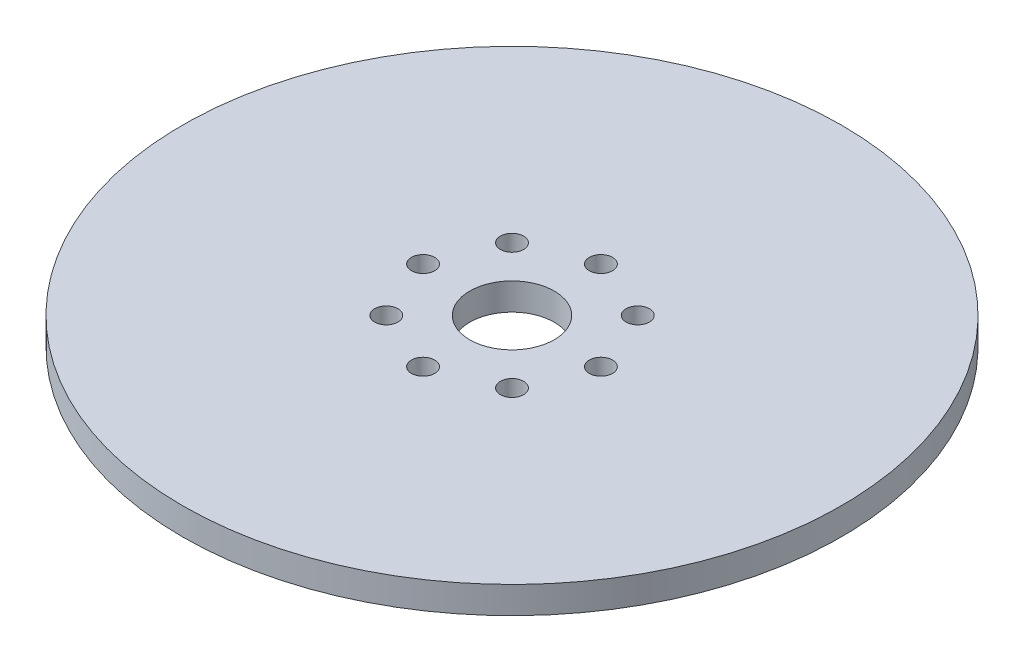
ISO-10303-21;
HEADER;
FILE_DESCRIPTION(('STEP AP214'),'2;1');
FILE_NAME('part.step','',(''),(''),'','','');
FILE_SCHEMA(('AUTOMOTIVE_DESIGN { 1 0 10303 214 1 1 1 1 }'));
ENDSEC;
DATA;
#1=APPLICATION_CONTEXT('core data for automotive mechanical design processes');
#2=APPLICATION_PROTOCOL_DEFINITION('international standard','automotive_design',2000,#1);
#3=PRODUCT_CONTEXT('',#1,'mechanical');
#4=PRODUCT('Part','Part','',(#3));
#5=PRODUCT_RELATED_PRODUCT_CATEGORY('part','',(#4));
#6=PRODUCT_DEFINITION_FORMATION('','',#4);
#7=PRODUCT_DEFINITION_CONTEXT('part definition',#1,'design');
#8=PRODUCT_DEFINITION('design','',#6,#7);
#9=PRODUCT_DEFINITION_SHAPE('','',#8);
#10=(LENGTH_UNIT() NAMED_UNIT(*) SI_UNIT(.MILLI.,.METRE.));
#11=(NAMED_UNIT(*) PLANE_ANGLE_UNIT() SI_UNIT($,.RADIAN.));
#12=(NAMED_UNIT(*) SI_UNIT($,.STERADIAN.) SOLID_ANGLE_UNIT());
#13=UNCERTAINTY_MEASURE_WITH_UNIT(LENGTH_MEASURE(1.E-05),#10,'distance_accuracy_value','');
#14=(GEOMETRIC_REPRESENTATION_CONTEXT(3) GLOBAL_UNCERTAINTY_ASSIGNED_CONTEXT((#13)) GLOBAL_UNIT_ASSIGNED_CONTEXT((#10,
#11,#12)) REPRESENTATION_CONTEXT('',''));
#15=CARTESIAN_POINT('',(0.,0.,0.));
#16=DIRECTION('',(0.,0.,1.));
#17=DIRECTION('',(1.,0.,0.));
#18=AXIS2_PLACEMENT_3D('',#15,#16,#17);
#19=CARTESIAN_POINT('',(0.,8.,0.));
#20=DIRECTION('',(0.,-1.,0.));
#21=DIRECTION('',(0.,0.,-1.));
#22=AXIS2_PLACEMENT_3D('',#19,#20,#21);
#23=CYLINDRICAL_SURFACE('',#22,97.5);
#24=CARTESIAN_POINT('',(0.,8.,0.));
#25=DIRECTION('',(0.,1.,0.));
#26=DIRECTION('',(0.,0.,1.));
#27=AXIS2_PLACEMENT_3D('',#24,#25,#26);
#28=CIRCLE('',#27,97.5);
#29=CARTESIAN_POINT('',(0.,8.,97.5));
#30=VERTEX_POINT('',#29);
#31=EDGE_CURVE('E10',#30,#30,#28,.T.);
#32=ORIENTED_EDGE('',*,*,#31,.F.);
#33=EDGE_LOOP('',(#32));
#34=FACE_BOUND('',#33,.T.);
#35=CARTESIAN_POINT('',(0.,0.,0.));
#36=DIRECTION('',(0.,1.,0.));
#37=DIRECTION('',(0.,0.,1.));
#38=AXIS2_PLACEMENT_3D('',#35,#36,#37);
#39=CIRCLE('',#38,97.5);
#40=CARTESIAN_POINT('',(0.,0.,97.5));
#41=VERTEX_POINT('',#40);
#42=EDGE_CURVE('E37',#41,#41,#39,.T.);
#43=ORIENTED_EDGE('',*,*,#42,.T.);
#44=EDGE_LOOP('',(#43));
#45=FACE_BOUND('',#44,.T.);
#46=ADVANCED_FACE('F40',(#34,#45),#23,.T.);
#47=CARTESIAN_POINT('',(0.,8.,0.));
#48=DIRECTION('',(0.,1.,0.));
#49=DIRECTION('',(0.,0.,1.));
#50=AXIS2_PLACEMENT_3D('',#47,#48,#49);
#51=PLANE('',#50);
#52=CARTESIAN_POINT('',(0.,8.,26.3054994431881));
#53=DIRECTION('',(0.,1.,0.));
#54=DIRECTION('',(1.,0.,0.));
#55=AXIS2_PLACEMENT_3D('',#52,#53,#54);
#56=CIRCLE('',#55,3.44191660066222);
#57=CARTESIAN_POINT('',(3.44191660066231,8.,26.305499443188));
#58=VERTEX_POINT('',#57);
#59=EDGE_CURVE('E88',#58,#58,#56,.T.);
#60=ORIENTED_EDGE('',*,*,#59,.F.);
#61=EDGE_LOOP('',(#60));
#62=FACE_BOUND('',#61,.T.);
#63=CARTESIAN_POINT('',(18.6007970387773,8.,18.6007970387771));
#64=DIRECTION('',(0.,1.,0.));
#65=DIRECTION('',(0.707106781186544,0.,-0.707106781186551));
#66=AXIS2_PLACEMENT_3D('',#63,#64,#65);
#67=CIRCLE('',#66,3.44191660066222);
#68=CARTESIAN_POINT('',(21.0345996073841,8.,16.1669944701703));
#69=VERTEX_POINT('',#68);
#70=EDGE_CURVE('E79',#69,#69,#67,.T.);
#71=ORIENTED_EDGE('',*,*,#70,.F.);
#72=EDGE_LOOP('',(#71));
#73=FACE_BOUND('',#72,.T.);
#74=CARTESIAN_POINT('',(26.3054994431881,8.,0.));
#75=DIRECTION('',(0.,1.,0.));
#76=DIRECTION('',(0.,0.,-1.));
#77=AXIS2_PLACEMENT_3D('',#74,#75,#76);
#78=CIRCLE('',#77,3.44191660066222);
#79=CARTESIAN_POINT('',(26.3054994431881,8.,-3.44191660066222));
#80=VERTEX_POINT('',#79);
#81=EDGE_CURVE('E74',#80,#80,#78,.T.);
#82=ORIENTED_EDGE('',*,*,#81,.F.);
#83=EDGE_LOOP('',(#82));
#84=FACE_BOUND('',#83,.T.);
#85=CARTESIAN_POINT('',(18.6007970387771,8.,-18.6007970387774));
#86=DIRECTION('',(0.,1.,0.));
#87=DIRECTION('',(-0.707106781186554,0.,-0.707106781186541));
#88=AXIS2_PLACEMENT_3D('',#85,#86,#87);
#89=CIRCLE('',#88,3.44191660066222);
#90=CARTESIAN_POINT('',(16.1669944701702,8.,-21.0345996073842));
#91=VERTEX_POINT('',#90);
#92=EDGE_CURVE('E70',#91,#91,#89,.T.);
#93=ORIENTED_EDGE('',*,*,#92,.F.);
#94=EDGE_LOOP('',(#93));
#95=FACE_BOUND('',#94,.T.);
#96=CARTESIAN_POINT('',(-2.75535481244519E-13,8.,-26.3054994431881));
#97=DIRECTION('',(0.,1.,0.));
#98=DIRECTION('',(-1.,0.,0.));
#99=AXIS2_PLACEMENT_3D('',#96,#97,#98);
#100=CIRCLE('',#99,3.44191660066222);
#101=CARTESIAN_POINT('',(-3.44191660066249,8.,-26.305499443188));
#102=VERTEX_POINT('',#101);
#103=EDGE_CURVE('E100',#102,#102,#100,.T.);
#104=ORIENTED_EDGE('',*,*,#103,.F.);
#105=EDGE_LOOP('',(#104));
#106=FACE_BOUND('',#105,.T.);
#107=CARTESIAN_POINT('',(-18.6007970387774,8.,-18.600797038777));
#108=DIRECTION('',(0.,1.,0.));
#109=DIRECTION('',(-0.707106781186539,0.,0.707106781186556));
#110=AXIS2_PLACEMENT_3D('',#107,#108,#109);
#111=CIRCLE('',#110,3.44191660066222);
#112=CARTESIAN_POINT('',(-21.0345996073842,8.,-16.1669944701702));
#113=VERTEX_POINT('',#112);
#114=EDGE_CURVE('E93',#113,#113,#111,.T.);
#115=ORIENTED_EDGE('',*,*,#114,.F.);
#116=EDGE_LOOP('',(#115));
#117=FACE_BOUND('',#116,.T.);
#118=CARTESIAN_POINT('',(-18.6007970387772,8.,18.6007970387773));
#119=DIRECTION('',(0.,1.,0.));
#120=DIRECTION('',(0.707106781186549,0.,0.707106781186546));
#121=AXIS2_PLACEMENT_3D('',#118,#119,#120);
#122=CIRCLE('',#121,3.44191660066222);
#123=CARTESIAN_POINT('',(-16.1669944701704,8.,21.0345996073841));
#124=VERTEX_POINT('',#123);
#125=EDGE_CURVE('E61',#124,#124,#122,.T.);
#126=ORIENTED_EDGE('',*,*,#125,.F.);
#127=EDGE_LOOP('',(#126));
#128=FACE_BOUND('',#127,.T.);
#129=CARTESIAN_POINT('',(-26.3054994431881,8.,0.));
#130=DIRECTION('',(0.,1.,0.));
#131=DIRECTION('',(0.,0.,1.));
#132=AXIS2_PLACEMENT_3D('',#129,#130,#131);
#133=CIRCLE('',#132,3.44191660066222);
#134=CARTESIAN_POINT('',(-26.3054994431881,8.,3.44191660066222));
#135=VERTEX_POINT('',#134);
#136=EDGE_CURVE('E54',#135,#135,#133,.T.);
#137=ORIENTED_EDGE('',*,*,#136,.F.);
#138=EDGE_LOOP('',(#137));
#139=FACE_BOUND('',#138,.T.);
#140=CARTESIAN_POINT('',(0.,8.,0.));
#141=DIRECTION('',(0.,1.,0.));
#142=DIRECTION('',(0.,0.,1.));
#143=AXIS2_PLACEMENT_3D('',#140,#141,#142);
#144=CIRCLE('',#143,12.5);
#145=CARTESIAN_POINT('',(0.,8.,12.5));
#146=VERTEX_POINT('',#145);
#147=EDGE_CURVE('E50',#146,#146,#144,.T.);
#148=ORIENTED_EDGE('',*,*,#147,.F.);
#149=EDGE_LOOP('',(#148));
#150=FACE_BOUND('',#149,.T.);
#151=ORIENTED_EDGE('',*,*,#31,.T.);
#152=EDGE_LOOP('',(#151));
#153=FACE_BOUND('',#152,.T.);
#154=ADVANCED_FACE('F115',(#62,#73,#84,#95,#106,#117,#128,#139,#150,#153),#51,.T.);
#155=CARTESIAN_POINT('',(0.,0.,0.));
#156=DIRECTION('',(0.,1.,0.));
#157=DIRECTION('',(0.,0.,1.));
#158=AXIS2_PLACEMENT_3D('',#155,#156,#157);
#159=PLANE('',#158);
#160=CARTESIAN_POINT('',(0.,0.,0.));
#161=DIRECTION('',(0.,1.,0.));
#162=DIRECTION('',(0.,0.,1.));
#163=AXIS2_PLACEMENT_3D('',#160,#161,#162);
#164=CIRCLE('',#163,12.5);
#165=CARTESIAN_POINT('',(0.,0.,12.5));
#166=VERTEX_POINT('',#165);
#167=EDGE_CURVE('E47',#166,#166,#164,.T.);
#168=ORIENTED_EDGE('',*,*,#167,.T.);
#169=EDGE_LOOP('',(#168));
#170=FACE_BOUND('',#169,.T.);
#171=ORIENTED_EDGE('',*,*,#42,.F.);
#172=EDGE_LOOP('',(#171));
#173=FACE_BOUND('',#172,.T.);
#174=ADVANCED_FACE('F113',(#170,#173),#159,.F.);
#175=CARTESIAN_POINT('',(0.,8.,0.));
#176=DIRECTION('',(0.,-1.,0.));
#177=DIRECTION('',(0.,0.,-1.));
#178=AXIS2_PLACEMENT_3D('',#175,#176,#177);
#179=CYLINDRICAL_SURFACE('',#178,12.5);
#180=ORIENTED_EDGE('',*,*,#147,.T.);
#181=EDGE_LOOP('',(#180));
#182=FACE_BOUND('',#181,.T.);
#183=ORIENTED_EDGE('',*,*,#167,.F.);
#184=EDGE_LOOP('',(#183));
#185=FACE_BOUND('',#184,.T.);
#186=ADVANCED_FACE('F127',(#182,#185),#179,.F.);
#187=CARTESIAN_POINT('',(-26.3054994431881,2.66079830665174,0.));
#188=DIRECTION('',(0.,1.,0.));
#189=DIRECTION('',(0.,0.,1.));
#190=AXIS2_PLACEMENT_3D('',#187,#188,#189);
#191=CYLINDRICAL_SURFACE('',#190,3.44191660066222);
#192=CARTESIAN_POINT('',(-26.3054994431881,2.66079830665174,0.));
#193=DIRECTION('',(0.,1.,0.));
#194=DIRECTION('',(0.,0.,1.));
#195=AXIS2_PLACEMENT_3D('',#192,#193,#194);
#196=CIRCLE('',#195,3.44191660066222);
#197=CARTESIAN_POINT('',(-26.3054994431881,2.66079830665174,3.44191660066222));
#198=VERTEX_POINT('',#197);
#199=EDGE_CURVE('E55',#198,#198,#196,.T.);
#200=ORIENTED_EDGE('',*,*,#199,.F.);
#201=EDGE_LOOP('',(#200));
#202=FACE_BOUND('',#201,.T.);
#203=ORIENTED_EDGE('',*,*,#136,.T.);
#204=EDGE_LOOP('',(#203));
#205=FACE_BOUND('',#204,.T.);
#206=ADVANCED_FACE('F129',(#202,#205),#191,.F.);
#207=CARTESIAN_POINT('',(-26.3054994431881,2.66079830665174,0.));
#208=DIRECTION('',(0.,1.,0.));
#209=DIRECTION('',(0.,0.,1.));
#210=AXIS2_PLACEMENT_3D('',#207,#208,#209);
#211=PLANE('',#210);
#212=ORIENTED_EDGE('',*,*,#199,.T.);
#213=EDGE_LOOP('',(#212));
#214=FACE_BOUND('',#213,.T.);
#215=ADVANCED_FACE('F157',(#214),#211,.T.);
#216=CARTESIAN_POINT('',(-18.6007970387772,2.66079830665174,18.6007970387773));
#217=DIRECTION('',(0.,1.,0.));
#218=DIRECTION('',(0.,0.,1.));
#219=AXIS2_PLACEMENT_3D('',#216,#217,#218);
#220=CYLINDRICAL_SURFACE('',#219,3.44191660066222);
#221=CARTESIAN_POINT('',(-18.6007970387772,2.66079830665174,18.6007970387773));
#222=DIRECTION('',(0.,1.,0.));
#223=DIRECTION('',(0.707106781186549,0.,0.707106781186546));
#224=AXIS2_PLACEMENT_3D('',#221,#222,#223);
#225=CIRCLE('',#224,3.44191660066222);
#226=CARTESIAN_POINT('',(-16.1669944701704,2.66079830665174,21.0345996073841));
#227=VERTEX_POINT('',#226);
#228=EDGE_CURVE('E59',#227,#227,#225,.T.);
#229=ORIENTED_EDGE('',*,*,#228,.F.);
#230=EDGE_LOOP('',(#229));
#231=FACE_BOUND('',#230,.T.);
#232=ORIENTED_EDGE('',*,*,#125,.T.);
#233=EDGE_LOOP('',(#232));
#234=FACE_BOUND('',#233,.T.);
#235=ADVANCED_FACE('F170',(#231,#234),#220,.F.);
#236=CARTESIAN_POINT('',(-18.6007970387772,2.66079830665174,18.6007970387773));
#237=DIRECTION('',(0.,1.,0.));
#238=DIRECTION('',(0.707106781186549,0.,0.707106781186546));
#239=AXIS2_PLACEMENT_3D('',#236,#237,#238);
#240=PLANE('',#239);
#241=ORIENTED_EDGE('',*,*,#228,.T.);
#242=EDGE_LOOP('',(#241));
#243=FACE_BOUND('',#242,.T.);
#244=ADVANCED_FACE('F182',(#243),#240,.T.);
#245=CARTESIAN_POINT('',(-18.6007970387774,2.66079830665174,-18.600797038777));
#246=DIRECTION('',(0.,1.,0.));
#247=DIRECTION('',(0.,0.,1.));
#248=AXIS2_PLACEMENT_3D('',#245,#246,#247);
#249=CYLINDRICAL_SURFACE('',#248,3.44191660066222);
#250=CARTESIAN_POINT('',(-18.6007970387774,2.66079830665174,-18.600797038777));
#251=DIRECTION('',(0.,1.,0.));
#252=DIRECTION('',(-0.707106781186539,0.,0.707106781186556));
#253=AXIS2_PLACEMENT_3D('',#250,#251,#252);
#254=CIRCLE('',#253,3.44191660066222);
#255=CARTESIAN_POINT('',(-21.0345996073842,2.66079830665174,-16.1669944701702));
#256=VERTEX_POINT('',#255);
#257=EDGE_CURVE('E94',#256,#256,#254,.T.);
#258=ORIENTED_EDGE('',*,*,#257,.F.);
#259=EDGE_LOOP('',(#258));
#260=FACE_BOUND('',#259,.T.);
#261=ORIENTED_EDGE('',*,*,#114,.T.);
#262=EDGE_LOOP('',(#261));
#263=FACE_BOUND('',#262,.T.);
#264=ADVANCED_FACE('F189',(#260,#263),#249,.F.);
#265=CARTESIAN_POINT('',(-18.6007970387774,2.66079830665174,-18.600797038777));
#266=DIRECTION('',(0.,1.,0.));
#267=DIRECTION('',(-0.707106781186539,0.,0.707106781186556));
#268=AXIS2_PLACEMENT_3D('',#265,#266,#267);
#269=PLANE('',#268);
#270=ORIENTED_EDGE('',*,*,#257,.T.);
#271=EDGE_LOOP('',(#270));
#272=FACE_BOUND('',#271,.T.);
#273=ADVANCED_FACE('F107',(#272),#269,.T.);
#274=CARTESIAN_POINT('',(-2.75535481244519E-13,2.66079830665174,-26.3054994431881));
#275=DIRECTION('',(0.,1.,0.));
#276=DIRECTION('',(0.,0.,1.));
#277=AXIS2_PLACEMENT_3D('',#274,#275,#276);
#278=CYLINDRICAL_SURFACE('',#277,3.44191660066222);
#279=CARTESIAN_POINT('',(-2.75535481244519E-13,2.66079830665174,-26.3054994431881));
#280=DIRECTION('',(0.,1.,0.));
#281=DIRECTION('',(-1.,0.,0.));
#282=AXIS2_PLACEMENT_3D('',#279,#280,#281);
#283=CIRCLE('',#282,3.44191660066222);
#284=CARTESIAN_POINT('',(-3.44191660066249,2.66079830665174,-26.305499443188));
#285=VERTEX_POINT('',#284);
#286=EDGE_CURVE('E72',#285,#285,#283,.T.);
#287=ORIENTED_EDGE('',*,*,#286,.F.);
#288=EDGE_LOOP('',(#287));
#289=FACE_BOUND('',#288,.T.);
#290=ORIENTED_EDGE('',*,*,#103,.T.);
#291=EDGE_LOOP('',(#290));
#292=FACE_BOUND('',#291,.T.);
#293=ADVANCED_FACE('F104',(#289,#292),#278,.F.);
#294=CARTESIAN_POINT('',(-2.75535481244519E-13,2.66079830665174,-26.3054994431881));
#295=DIRECTION('',(0.,1.,0.));
#296=DIRECTION('',(-1.,0.,0.));
#297=AXIS2_PLACEMENT_3D('',#294,#295,#296);
#298=PLANE('',#297);
#299=ORIENTED_EDGE('',*,*,#286,.T.);
#300=EDGE_LOOP('',(#299));
#301=FACE_BOUND('',#300,.T.);
#302=ADVANCED_FACE('F103',(#301),#298,.T.);
#303=CARTESIAN_POINT('',(18.6007970387771,2.66079830665174,-18.6007970387774));
#304=DIRECTION('',(0.,1.,0.));
#305=DIRECTION('',(0.,0.,1.));
#306=AXIS2_PLACEMENT_3D('',#303,#304,#305);
#307=CYLINDRICAL_SURFACE('',#306,3.44191660066222);
#308=CARTESIAN_POINT('',(18.6007970387771,2.66079830665174,-18.6007970387774));
#309=DIRECTION('',(0.,1.,0.));
#310=DIRECTION('',(-0.707106781186554,0.,-0.707106781186541));
#311=AXIS2_PLACEMENT_3D('',#308,#309,#310);
#312=CIRCLE('',#311,3.44191660066222);
#313=CARTESIAN_POINT('',(16.1669944701702,2.66079830665174,-21.0345996073842));
#314=VERTEX_POINT('',#313);
#315=EDGE_CURVE('E69',#314,#314,#312,.T.);
#316=ORIENTED_EDGE('',*,*,#315,.F.);
#317=EDGE_LOOP('',(#316));
#318=FACE_BOUND('',#317,.T.);
#319=ORIENTED_EDGE('',*,*,#92,.T.);
#320=EDGE_LOOP('',(#319));
#321=FACE_BOUND('',#320,.T.);
#322=ADVANCED_FACE('F219',(#318,#321),#307,.F.);
#323=CARTESIAN_POINT('',(18.6007970387771,2.66079830665174,-18.6007970387774));
#324=DIRECTION('',(0.,1.,0.));
#325=DIRECTION('',(-0.707106781186554,0.,-0.707106781186541));
#326=AXIS2_PLACEMENT_3D('',#323,#324,#325);
#327=PLANE('',#326);
#328=ORIENTED_EDGE('',*,*,#315,.T.);
#329=EDGE_LOOP('',(#328));
#330=FACE_BOUND('',#329,.T.);
#331=ADVANCED_FACE('F227',(#330),#327,.T.);
#332=CARTESIAN_POINT('',(26.3054994431881,2.66079830665174,0.));
#333=DIRECTION('',(0.,1.,0.));
#334=DIRECTION('',(0.,0.,1.));
#335=AXIS2_PLACEMENT_3D('',#332,#333,#334);
#336=CYLINDRICAL_SURFACE('',#335,3.44191660066222);
#337=CARTESIAN_POINT('',(26.3054994431881,2.66079830665174,0.));
#338=DIRECTION('',(0.,1.,0.));
#339=DIRECTION('',(0.,0.,-1.));
#340=AXIS2_PLACEMENT_3D('',#337,#338,#339);
#341=CIRCLE('',#340,3.44191660066222);
#342=CARTESIAN_POINT('',(26.3054994431881,2.66079830665174,-3.44191660066222));
#343=VERTEX_POINT('',#342);
#344=EDGE_CURVE('E80',#343,#343,#341,.T.);
#345=ORIENTED_EDGE('',*,*,#344,.F.);
#346=EDGE_LOOP('',(#345));
#347=FACE_BOUND('',#346,.T.);
#348=ORIENTED_EDGE('',*,*,#81,.T.);
#349=EDGE_LOOP('',(#348));
#350=FACE_BOUND('',#349,.T.);
#351=ADVANCED_FACE('F240',(#347,#350),#336,.F.);
#352=CARTESIAN_POINT('',(26.3054994431881,2.66079830665174,0.));
#353=DIRECTION('',(0.,1.,0.));
#354=DIRECTION('',(0.,0.,-1.));
#355=AXIS2_PLACEMENT_3D('',#352,#353,#354);
#356=PLANE('',#355);
#357=ORIENTED_EDGE('',*,*,#344,.T.);
#358=EDGE_LOOP('',(#357));
#359=FACE_BOUND('',#358,.T.);
#360=ADVANCED_FACE('F246',(#359),#356,.T.);
#361=CARTESIAN_POINT('',(18.6007970387773,2.66079830665174,18.6007970387771));
#362=DIRECTION('',(0.,1.,0.));
#363=DIRECTION('',(0.,0.,1.));
#364=AXIS2_PLACEMENT_3D('',#361,#362,#363);
#365=CYLINDRICAL_SURFACE('',#364,3.44191660066222);
#366=CARTESIAN_POINT('',(18.6007970387773,2.66079830665174,18.6007970387771));
#367=DIRECTION('',(0.,1.,0.));
#368=DIRECTION('',(0.707106781186544,0.,-0.707106781186551));
#369=AXIS2_PLACEMENT_3D('',#366,#367,#368);
#370=CIRCLE('',#369,3.44191660066222);
#371=CARTESIAN_POINT('',(21.0345996073841,2.66079830665174,16.1669944701703));
#372=VERTEX_POINT('',#371);
#373=EDGE_CURVE('E82',#372,#372,#370,.T.);
#374=ORIENTED_EDGE('',*,*,#373,.F.);
#375=EDGE_LOOP('',(#374));
#376=FACE_BOUND('',#375,.T.);
#377=ORIENTED_EDGE('',*,*,#70,.T.);
#378=EDGE_LOOP('',(#377));
#379=FACE_BOUND('',#378,.T.);
#380=ADVANCED_FACE('F254',(#376,#379),#365,.F.);
#381=CARTESIAN_POINT('',(18.6007970387773,2.66079830665174,18.6007970387771));
#382=DIRECTION('',(0.,1.,0.));
#383=DIRECTION('',(0.707106781186544,0.,-0.707106781186551));
#384=AXIS2_PLACEMENT_3D('',#381,#382,#383);
#385=PLANE('',#384);
#386=ORIENTED_EDGE('',*,*,#373,.T.);
#387=EDGE_LOOP('',(#386));
#388=FACE_BOUND('',#387,.T.);
#389=ADVANCED_FACE('F262',(#388),#385,.T.);
#390=CARTESIAN_POINT('',(0.,2.66079830665174,26.3054994431881));
#391=DIRECTION('',(0.,1.,0.));
#392=DIRECTION('',(0.,0.,1.));
#393=AXIS2_PLACEMENT_3D('',#390,#391,#392);
#394=CYLINDRICAL_SURFACE('',#393,3.44191660066222);
#395=CARTESIAN_POINT('',(0.,2.66079830665174,26.3054994431881));
#396=DIRECTION('',(0.,1.,0.));
#397=DIRECTION('',(1.,0.,0.));
#398=AXIS2_PLACEMENT_3D('',#395,#396,#397);
#399=CIRCLE('',#398,3.44191660066222);
#400=CARTESIAN_POINT('',(3.44191660066231,2.66079830665174,26.305499443188));
#401=VERTEX_POINT('',#400);
#402=EDGE_CURVE('E63',#401,#401,#399,.T.);
#403=ORIENTED_EDGE('',*,*,#402,.F.);
#404=EDGE_LOOP('',(#403));
#405=FACE_BOUND('',#404,.T.);
#406=ORIENTED_EDGE('',*,*,#59,.T.);
#407=EDGE_LOOP('',(#406));
#408=FACE_BOUND('',#407,.T.);
#409=ADVANCED_FACE('F272',(#405,#408),#394,.F.);
#410=CARTESIAN_POINT('',(0.,2.66079830665174,26.3054994431881));
#411=DIRECTION('',(0.,1.,0.));
#412=DIRECTION('',(1.,0.,0.));
#413=AXIS2_PLACEMENT_3D('',#410,#411,#412);
#414=PLANE('',#413);
#415=ORIENTED_EDGE('',*,*,#402,.T.);
#416=EDGE_LOOP('',(#415));
#417=FACE_BOUND('',#416,.T.);
#418=ADVANCED_FACE('F285',(#417),#414,.T.);
#419=CLOSED_SHELL('',(#46,#154,#174,#186,#206,#215,#235,#244,#264,#273,#293,#302,#322,#331,#351,
#360,#380,#389,#409,#418));
#420=MANIFOLD_SOLID_BREP('B2',#419);
#421=ADVANCED_BREP_SHAPE_REPRESENTATION('',(#18,#420),#14);
#422=SHAPE_DEFINITION_REPRESENTATION(#9,#421);
ENDSEC;
END-ISO-10303-21;
